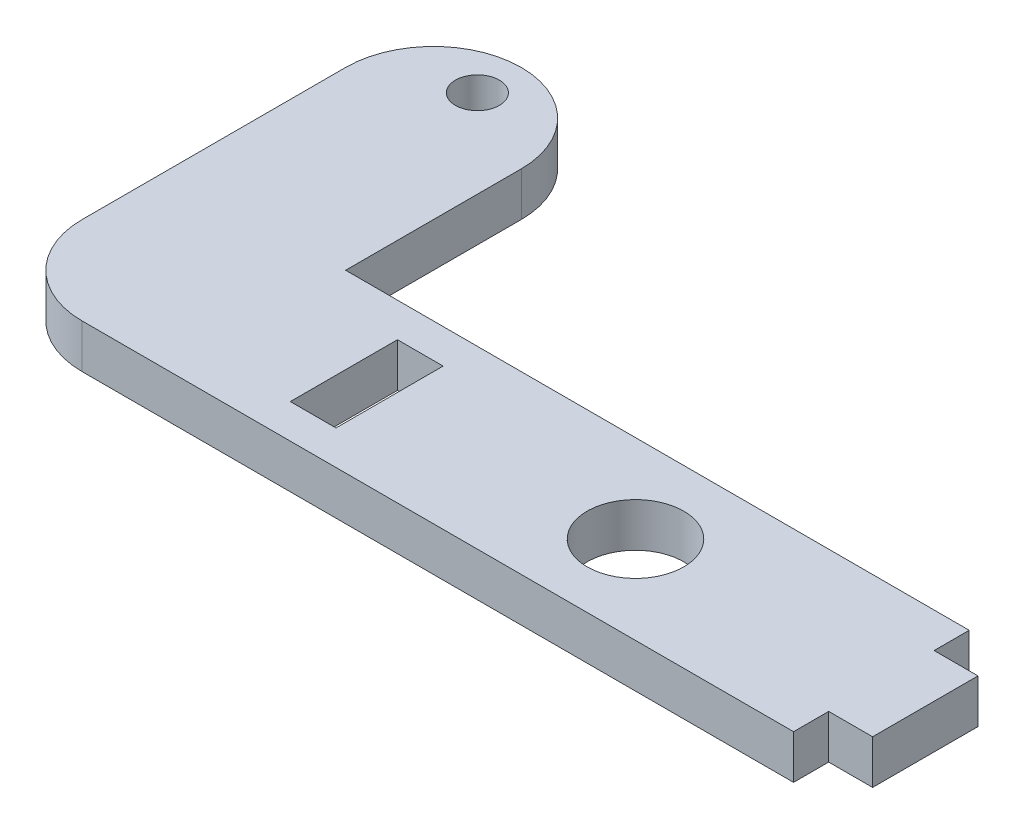
ISO-10303-21;
HEADER;
FILE_DESCRIPTION(('STEP AP214'),'2;1');
FILE_NAME('part.step','',(''),(''),'','','');
FILE_SCHEMA(('AUTOMOTIVE_DESIGN { 1 0 10303 214 1 1 1 1 }'));
ENDSEC;
DATA;
#1=APPLICATION_CONTEXT('core data for automotive mechanical design processes');
#2=APPLICATION_PROTOCOL_DEFINITION('international standard','automotive_design',2000,#1);
#3=PRODUCT_CONTEXT('',#1,'mechanical');
#4=PRODUCT('Part','Part','',(#3));
#5=PRODUCT_RELATED_PRODUCT_CATEGORY('part','',(#4));
#6=PRODUCT_DEFINITION_FORMATION('','',#4);
#7=PRODUCT_DEFINITION_CONTEXT('part definition',#1,'design');
#8=PRODUCT_DEFINITION('design','',#6,#7);
#9=PRODUCT_DEFINITION_SHAPE('','',#8);
#10=(LENGTH_UNIT() NAMED_UNIT(*) SI_UNIT(.MILLI.,.METRE.));
#11=(NAMED_UNIT(*) PLANE_ANGLE_UNIT() SI_UNIT($,.RADIAN.));
#12=(NAMED_UNIT(*) SI_UNIT($,.STERADIAN.) SOLID_ANGLE_UNIT());
#13=UNCERTAINTY_MEASURE_WITH_UNIT(LENGTH_MEASURE(1.E-05),#10,'distance_accuracy_value','');
#14=(GEOMETRIC_REPRESENTATION_CONTEXT(3) GLOBAL_UNCERTAINTY_ASSIGNED_CONTEXT((#13)) GLOBAL_UNIT_ASSIGNED_CONTEXT((#10,
#11,#12)) REPRESENTATION_CONTEXT('',''));
#15=CARTESIAN_POINT('',(0.,0.,0.));
#16=DIRECTION('',(0.,0.,1.));
#17=DIRECTION('',(1.,0.,0.));
#18=AXIS2_PLACEMENT_3D('',#15,#16,#17);
#19=CARTESIAN_POINT('',(-41.1780502588684,14.4756677402543,1.31851689110202));
#20=DIRECTION('',(0.,1.,0.));
#21=DIRECTION('',(0.,0.,1.));
#22=AXIS2_PLACEMENT_3D('',#19,#20,#21);
#23=CYLINDRICAL_SURFACE('',#22,6.35);
#24=DIRECTION('',(0.,1.,0.));
#25=VECTOR('',#24,1.);
#26=CARTESIAN_POINT('',(-47.5280502588684,14.4756677402543,1.31851689110202));
#27=LINE('',#26,#25);
#28=CARTESIAN_POINT('',(-47.5280502588684,11.3006677402543,1.31851689110202));
#29=VERTEX_POINT('',#28);
#30=CARTESIAN_POINT('',(-47.5280502588684,14.4756677402543,1.31851689110202));
#31=VERTEX_POINT('',#30);
#32=EDGE_CURVE('E276',#29,#31,#27,.T.);
#33=ORIENTED_EDGE('',*,*,#32,.F.);
#34=CARTESIAN_POINT('',(-41.1780502588684,11.3006677402543,1.31851689110202));
#35=DIRECTION('',(0.,-1.,0.));
#36=DIRECTION('',(0.,0.,-1.));
#37=AXIS2_PLACEMENT_3D('',#34,#35,#36);
#38=CIRCLE('',#37,6.35);
#39=CARTESIAN_POINT('',(-41.1780502588684,11.3006677402543,7.66851689110202));
#40=VERTEX_POINT('',#39);
#41=EDGE_CURVE('E39',#40,#29,#38,.T.);
#42=ORIENTED_EDGE('',*,*,#41,.F.);
#43=DIRECTION('',(0.,1.,0.));
#44=VECTOR('',#43,1.);
#45=CARTESIAN_POINT('',(-41.1780502588684,14.4756677402543,7.66851689110202));
#46=LINE('',#45,#44);
#47=CARTESIAN_POINT('',(-41.1780502588684,14.4756677402543,7.66851689110202));
#48=VERTEX_POINT('',#47);
#49=EDGE_CURVE('E279',#48,#40,#46,.F.);
#50=ORIENTED_EDGE('',*,*,#49,.F.);
#51=CARTESIAN_POINT('',(-41.1780502588684,14.4756677402543,1.31851689110202));
#52=DIRECTION('',(0.,-1.,0.));
#53=DIRECTION('',(0.,0.,-1.));
#54=AXIS2_PLACEMENT_3D('',#51,#52,#53);
#55=CIRCLE('',#54,6.35);
#56=EDGE_CURVE('E11',#31,#48,#55,.F.);
#57=ORIENTED_EDGE('',*,*,#56,.F.);
#58=EDGE_LOOP('',(#33,#42,#50,#57));
#59=FACE_BOUND('',#58,.T.);
#60=ADVANCED_FACE('F32',(#59),#23,.T.);
#61=CARTESIAN_POINT('',(-41.1780502588684,14.4756677402543,-17.731483108898));
#62=DIRECTION('',(0.,-1.,0.));
#63=DIRECTION('',(0.,0.,-1.));
#64=AXIS2_PLACEMENT_3D('',#61,#62,#63);
#65=CYLINDRICAL_SURFACE('',#64,6.35);
#66=DIRECTION('',(0.,1.,0.));
#67=VECTOR('',#66,1.);
#68=CARTESIAN_POINT('',(-41.1780502588684,14.4756677402543,-24.081483108898));
#69=LINE('',#68,#67);
#70=CARTESIAN_POINT('',(-41.1780502588684,11.3006677402543,-24.081483108898));
#71=VERTEX_POINT('',#70);
#72=CARTESIAN_POINT('',(-41.1780502588684,14.4756677402543,-24.081483108898));
#73=VERTEX_POINT('',#72);
#74=EDGE_CURVE('E258',#71,#73,#69,.T.);
#75=ORIENTED_EDGE('',*,*,#74,.T.);
#76=CARTESIAN_POINT('',(-41.1780502588684,14.4756677402543,-17.731483108898));
#77=DIRECTION('',(0.,-1.,0.));
#78=DIRECTION('',(0.,0.,-1.));
#79=AXIS2_PLACEMENT_3D('',#76,#77,#78);
#80=CIRCLE('',#79,6.35);
#81=CARTESIAN_POINT('',(-34.8280502588684,14.4756677402543,-17.731483108898));
#82=VERTEX_POINT('',#81);
#83=EDGE_CURVE('E272',#82,#73,#80,.F.);
#84=ORIENTED_EDGE('',*,*,#83,.F.);
#85=DIRECTION('',(0.,-1.,0.));
#86=VECTOR('',#85,1.);
#87=CARTESIAN_POINT('',(-34.8280502588684,14.4756677402543,-17.731483108898));
#88=LINE('',#87,#86);
#89=CARTESIAN_POINT('',(-34.8280502588684,11.3006677402543,-17.731483108898));
#90=VERTEX_POINT('',#89);
#91=EDGE_CURVE('E269',#90,#82,#88,.F.);
#92=ORIENTED_EDGE('',*,*,#91,.F.);
#93=CARTESIAN_POINT('',(-41.1780502588684,11.3006677402543,-17.731483108898));
#94=DIRECTION('',(0.,-1.,0.));
#95=DIRECTION('',(0.,0.,-1.));
#96=AXIS2_PLACEMENT_3D('',#93,#94,#95);
#97=CIRCLE('',#96,6.35);
#98=EDGE_CURVE('E274',#71,#90,#97,.T.);
#99=ORIENTED_EDGE('',*,*,#98,.F.);
#100=EDGE_LOOP('',(#75,#84,#92,#99));
#101=FACE_BOUND('',#100,.T.);
#102=ADVANCED_FACE('F293',(#101),#65,.T.);
#103=CARTESIAN_POINT('',(-41.1780502588684,14.4756677402543,-17.731483108898));
#104=DIRECTION('',(0.,1.,0.));
#105=DIRECTION('',(0.,0.,1.));
#106=AXIS2_PLACEMENT_3D('',#103,#104,#105);
#107=CYLINDRICAL_SURFACE('',#106,6.35);
#108=ORIENTED_EDGE('',*,*,#74,.F.);
#109=CARTESIAN_POINT('',(-41.1780502588684,11.3006677402543,-17.731483108898));
#110=DIRECTION('',(0.,-1.,0.));
#111=DIRECTION('',(0.,0.,-1.));
#112=AXIS2_PLACEMENT_3D('',#109,#110,#111);
#113=CIRCLE('',#112,6.35);
#114=CARTESIAN_POINT('',(-47.5280502588684,11.3006677402543,-17.731483108898));
#115=VERTEX_POINT('',#114);
#116=EDGE_CURVE('E264',#115,#71,#113,.T.);
#117=ORIENTED_EDGE('',*,*,#116,.F.);
#118=DIRECTION('',(0.,1.,0.));
#119=VECTOR('',#118,1.);
#120=CARTESIAN_POINT('',(-47.5280502588684,14.4756677402543,-17.731483108898));
#121=LINE('',#120,#119);
#122=CARTESIAN_POINT('',(-47.5280502588684,14.4756677402543,-17.731483108898));
#123=VERTEX_POINT('',#122);
#124=EDGE_CURVE('E261',#123,#115,#121,.F.);
#125=ORIENTED_EDGE('',*,*,#124,.F.);
#126=CARTESIAN_POINT('',(-41.1780502588684,14.4756677402543,-17.731483108898));
#127=DIRECTION('',(0.,-1.,0.));
#128=DIRECTION('',(0.,0.,-1.));
#129=AXIS2_PLACEMENT_3D('',#126,#127,#128);
#130=CIRCLE('',#129,6.35);
#131=EDGE_CURVE('E267',#73,#123,#130,.F.);
#132=ORIENTED_EDGE('',*,*,#131,.F.);
#133=EDGE_LOOP('',(#108,#117,#125,#132));
#134=FACE_BOUND('',#133,.T.);
#135=ADVANCED_FACE('F288',(#134),#107,.T.);
#136=CARTESIAN_POINT('',(-17.0480502588684,14.4756677402543,1.31851689110202));
#137=DIRECTION('',(0.,-1.,0.));
#138=DIRECTION('',(0.,0.,-1.));
#139=AXIS2_PLACEMENT_3D('',#136,#137,#138);
#140=PLANE('',#139);
#141=CARTESIAN_POINT('',(-7.52305025886841,14.4756677402543,1.31851689110202));
#142=DIRECTION('',(0.,1.,0.));
#143=DIRECTION('',(0.,0.,1.));
#144=AXIS2_PLACEMENT_3D('',#141,#142,#143);
#145=CIRCLE('',#144,3.4925);
#146=CARTESIAN_POINT('',(-7.52305025886841,14.4756677402543,4.81101689110202));
#147=VERTEX_POINT('',#146);
#148=EDGE_CURVE('E171',#147,#147,#145,.T.);
#149=ORIENTED_EDGE('',*,*,#148,.F.);
#150=EDGE_LOOP('',(#149));
#151=FACE_BOUND('',#150,.T.);
#152=CARTESIAN_POINT('',(-41.1780502588684,14.4756677402543,-20.906483108898));
#153=DIRECTION('',(0.,1.,0.));
#154=DIRECTION('',(0.,0.,1.));
#155=AXIS2_PLACEMENT_3D('',#152,#153,#154);
#156=CIRCLE('',#155,1.5875);
#157=CARTESIAN_POINT('',(-41.1780502588684,14.4756677402543,-19.318983108898));
#158=VERTEX_POINT('',#157);
#159=EDGE_CURVE('E228',#158,#158,#156,.T.);
#160=ORIENTED_EDGE('',*,*,#159,.F.);
#161=EDGE_LOOP('',(#160));
#162=FACE_BOUND('',#161,.T.);
#163=DIRECTION('',(0.,0.,1.));
#164=VECTOR('',#163,1.);
#165=CARTESIAN_POINT('',(-47.5280502588684,14.4756677402543,-5.03148310889799));
#166=LINE('',#165,#164);
#167=EDGE_CURVE('E234',#123,#31,#166,.T.);
#168=ORIENTED_EDGE('',*,*,#167,.T.);
#169=ORIENTED_EDGE('',*,*,#56,.T.);
#170=DIRECTION('',(1.,0.,0.));
#171=VECTOR('',#170,1.);
#172=CARTESIAN_POINT('',(-47.5280502588684,14.4756677402543,7.66851689110202));
#173=LINE('',#172,#171);
#174=CARTESIAN_POINT('',(10.2569497411316,14.4756677402543,7.66851689110202));
#175=VERTEX_POINT('',#174);
#176=EDGE_CURVE('E236',#48,#175,#173,.T.);
#177=ORIENTED_EDGE('',*,*,#176,.T.);
#178=DIRECTION('',(0.,0.,1.));
#179=VECTOR('',#178,1.);
#180=CARTESIAN_POINT('',(10.2569497411316,14.4756677402543,7.66851689110202));
#181=LINE('',#180,#179);
#182=CARTESIAN_POINT('',(10.2569497411316,14.4756677402543,5.12851689110202));
#183=VERTEX_POINT('',#182);
#184=EDGE_CURVE('E167',#183,#175,#181,.T.);
#185=ORIENTED_EDGE('',*,*,#184,.F.);
#186=DIRECTION('',(-1.,0.,0.));
#187=VECTOR('',#186,1.);
#188=CARTESIAN_POINT('',(13.4319497411316,14.4756677402543,5.12851689110202));
#189=LINE('',#188,#187);
#190=CARTESIAN_POINT('',(13.4319497411316,14.4756677402543,5.12851689110202));
#191=VERTEX_POINT('',#190);
#192=EDGE_CURVE('E147',#191,#183,#189,.T.);
#193=ORIENTED_EDGE('',*,*,#192,.F.);
#194=DIRECTION('',(0.,0.,-1.));
#195=VECTOR('',#194,1.);
#196=CARTESIAN_POINT('',(13.4319497411316,14.4756677402543,-5.03148310889798));
#197=LINE('',#196,#195);
#198=CARTESIAN_POINT('',(13.4319497411316,14.4756677402543,-2.49148310889798));
#199=VERTEX_POINT('',#198);
#200=EDGE_CURVE('E239',#191,#199,#197,.T.);
#201=ORIENTED_EDGE('',*,*,#200,.T.);
#202=DIRECTION('',(1.,0.,0.));
#203=VECTOR('',#202,1.);
#204=CARTESIAN_POINT('',(13.4319497411316,14.4756677402543,-2.49148310889798));
#205=LINE('',#204,#203);
#206=CARTESIAN_POINT('',(10.2569497411316,14.4756677402543,-2.49148310889798));
#207=VERTEX_POINT('',#206);
#208=EDGE_CURVE('E183',#207,#199,#205,.T.);
#209=ORIENTED_EDGE('',*,*,#208,.F.);
#210=DIRECTION('',(0.,0.,1.));
#211=VECTOR('',#210,1.);
#212=CARTESIAN_POINT('',(10.2569497411316,14.4756677402543,-5.03148310889798));
#213=LINE('',#212,#211);
#214=CARTESIAN_POINT('',(10.2569497411316,14.4756677402543,-5.03148310889798));
#215=VERTEX_POINT('',#214);
#216=EDGE_CURVE('E176',#215,#207,#213,.T.);
#217=ORIENTED_EDGE('',*,*,#216,.F.);
#218=DIRECTION('',(-1.,0.,0.));
#219=VECTOR('',#218,1.);
#220=CARTESIAN_POINT('',(13.4319497411316,14.4756677402543,-5.03148310889798));
#221=LINE('',#220,#219);
#222=CARTESIAN_POINT('',(-34.8280502588684,14.4756677402543,-5.03148310889798));
#223=VERTEX_POINT('',#222);
#224=EDGE_CURVE('E241',#215,#223,#221,.T.);
#225=ORIENTED_EDGE('',*,*,#224,.T.);
#226=DIRECTION('',(0.,0.,-1.));
#227=VECTOR('',#226,1.);
#228=CARTESIAN_POINT('',(-34.8280502588684,14.4756677402543,-5.03148310889798));
#229=LINE('',#228,#227);
#230=EDGE_CURVE('E243',#223,#82,#229,.T.);
#231=ORIENTED_EDGE('',*,*,#230,.T.);
#232=ORIENTED_EDGE('',*,*,#83,.T.);
#233=ORIENTED_EDGE('',*,*,#131,.T.);
#234=EDGE_LOOP('',(#168,#169,#177,#185,#193,#201,#209,#217,#225,#231,#232,#233));
#235=FACE_BOUND('',#234,.T.);
#236=DIRECTION('',(0.,0.,1.));
#237=VECTOR('',#236,1.);
#238=CARTESIAN_POINT('',(-28.6050502588684,14.4756677402543,-2.55498310889798));
#239=LINE('',#238,#237);
#240=CARTESIAN_POINT('',(-28.6050502588684,14.4756677402543,-2.55498310889798));
#241=VERTEX_POINT('',#240);
#242=CARTESIAN_POINT('',(-28.6050502588684,14.4756677402543,5.19201689110202));
#243=VERTEX_POINT('',#242);
#244=EDGE_CURVE('E197',#241,#243,#239,.T.);
#245=ORIENTED_EDGE('',*,*,#244,.F.);
#246=DIRECTION('',(-1.,0.,0.));
#247=VECTOR('',#246,1.);
#248=CARTESIAN_POINT('',(-28.6050502588684,14.4756677402543,-2.55498310889798));
#249=LINE('',#248,#247);
#250=CARTESIAN_POINT('',(-25.3030502588684,14.4756677402543,-2.55498310889798));
#251=VERTEX_POINT('',#250);
#252=EDGE_CURVE('E205',#251,#241,#249,.T.);
#253=ORIENTED_EDGE('',*,*,#252,.F.);
#254=DIRECTION('',(0.,0.,-1.));
#255=VECTOR('',#254,1.);
#256=CARTESIAN_POINT('',(-25.3030502588684,14.4756677402543,-2.55498310889798));
#257=LINE('',#256,#255);
#258=CARTESIAN_POINT('',(-25.3030502588684,14.4756677402543,5.19201689110202));
#259=VERTEX_POINT('',#258);
#260=EDGE_CURVE('E202',#259,#251,#257,.T.);
#261=ORIENTED_EDGE('',*,*,#260,.F.);
#262=DIRECTION('',(1.,0.,0.));
#263=VECTOR('',#262,1.);
#264=CARTESIAN_POINT('',(-28.6050502588684,14.4756677402543,5.19201689110202));
#265=LINE('',#264,#263);
#266=EDGE_CURVE('E199',#243,#259,#265,.T.);
#267=ORIENTED_EDGE('',*,*,#266,.F.);
#268=EDGE_LOOP('',(#245,#253,#261,#267));
#269=FACE_BOUND('',#268,.T.);
#270=ADVANCED_FACE('F313',(#151,#162,#235,#269),#140,.F.);
#271=CARTESIAN_POINT('',(-17.0480502588684,11.3006677402543,1.31851689110202));
#272=DIRECTION('',(0.,-1.,0.));
#273=DIRECTION('',(0.,0.,-1.));
#274=AXIS2_PLACEMENT_3D('',#271,#272,#273);
#275=PLANE('',#274);
#276=CARTESIAN_POINT('',(-7.52305025886841,11.3006677402543,1.31851689110202));
#277=DIRECTION('',(0.,1.,0.));
#278=DIRECTION('',(0.,0.,1.));
#279=AXIS2_PLACEMENT_3D('',#276,#277,#278);
#280=CIRCLE('',#279,3.4925);
#281=CARTESIAN_POINT('',(-7.52305025886841,11.3006677402543,4.81101689110202));
#282=VERTEX_POINT('',#281);
#283=EDGE_CURVE('E174',#282,#282,#280,.T.);
#284=ORIENTED_EDGE('',*,*,#283,.T.);
#285=EDGE_LOOP('',(#284));
#286=FACE_BOUND('',#285,.T.);
#287=DIRECTION('',(1.,0.,0.));
#288=VECTOR('',#287,1.);
#289=CARTESIAN_POINT('',(-47.5280502588684,11.3006677402543,7.66851689110202));
#290=LINE('',#289,#288);
#291=CARTESIAN_POINT('',(10.2569497411316,11.3006677402543,7.66851689110202));
#292=VERTEX_POINT('',#291);
#293=EDGE_CURVE('E249',#40,#292,#290,.T.);
#294=ORIENTED_EDGE('',*,*,#293,.F.);
#295=ORIENTED_EDGE('',*,*,#41,.T.);
#296=DIRECTION('',(0.,0.,1.));
#297=VECTOR('',#296,1.);
#298=CARTESIAN_POINT('',(-47.5280502588684,11.3006677402543,-5.03148310889799));
#299=LINE('',#298,#297);
#300=EDGE_CURVE('E231',#115,#29,#299,.T.);
#301=ORIENTED_EDGE('',*,*,#300,.F.);
#302=ORIENTED_EDGE('',*,*,#116,.T.);
#303=ORIENTED_EDGE('',*,*,#98,.T.);
#304=DIRECTION('',(0.,0.,-1.));
#305=VECTOR('',#304,1.);
#306=CARTESIAN_POINT('',(-34.8280502588684,11.3006677402543,-5.03148310889798));
#307=LINE('',#306,#305);
#308=CARTESIAN_POINT('',(-34.8280502588684,11.3006677402543,-5.03148310889798));
#309=VERTEX_POINT('',#308);
#310=EDGE_CURVE('E237',#309,#90,#307,.T.);
#311=ORIENTED_EDGE('',*,*,#310,.F.);
#312=DIRECTION('',(-1.,0.,0.));
#313=VECTOR('',#312,1.);
#314=CARTESIAN_POINT('',(13.4319497411316,11.3006677402543,-5.03148310889798));
#315=LINE('',#314,#313);
#316=CARTESIAN_POINT('',(10.2569497411316,11.3006677402543,-5.03148310889798));
#317=VERTEX_POINT('',#316);
#318=EDGE_CURVE('E252',#317,#309,#315,.T.);
#319=ORIENTED_EDGE('',*,*,#318,.F.);
#320=DIRECTION('',(0.,0.,1.));
#321=VECTOR('',#320,1.);
#322=CARTESIAN_POINT('',(10.2569497411316,11.3006677402543,-5.03148310889798));
#323=LINE('',#322,#321);
#324=CARTESIAN_POINT('',(10.2569497411316,11.3006677402543,-2.49148310889798));
#325=VERTEX_POINT('',#324);
#326=EDGE_CURVE('E179',#317,#325,#323,.T.);
#327=ORIENTED_EDGE('',*,*,#326,.T.);
#328=DIRECTION('',(1.,0.,0.));
#329=VECTOR('',#328,1.);
#330=CARTESIAN_POINT('',(13.4319497411316,11.3006677402543,-2.49148310889798));
#331=LINE('',#330,#329);
#332=CARTESIAN_POINT('',(13.4319497411316,11.3006677402543,-2.49148310889798));
#333=VERTEX_POINT('',#332);
#334=EDGE_CURVE('E182',#325,#333,#331,.T.);
#335=ORIENTED_EDGE('',*,*,#334,.T.);
#336=DIRECTION('',(0.,0.,-1.));
#337=VECTOR('',#336,1.);
#338=CARTESIAN_POINT('',(13.4319497411316,11.3006677402543,-5.03148310889798));
#339=LINE('',#338,#337);
#340=CARTESIAN_POINT('',(13.4319497411316,11.3006677402543,5.12851689110202));
#341=VERTEX_POINT('',#340);
#342=EDGE_CURVE('E166',#341,#333,#339,.T.);
#343=ORIENTED_EDGE('',*,*,#342,.F.);
#344=DIRECTION('',(-1.,0.,0.));
#345=VECTOR('',#344,1.);
#346=CARTESIAN_POINT('',(13.4319497411316,11.3006677402543,5.12851689110202));
#347=LINE('',#346,#345);
#348=CARTESIAN_POINT('',(10.2569497411316,11.3006677402543,5.12851689110202));
#349=VERTEX_POINT('',#348);
#350=EDGE_CURVE('E144',#341,#349,#347,.T.);
#351=ORIENTED_EDGE('',*,*,#350,.T.);
#352=DIRECTION('',(0.,0.,1.));
#353=VECTOR('',#352,1.);
#354=CARTESIAN_POINT('',(10.2569497411316,11.3006677402543,7.66851689110202));
#355=LINE('',#354,#353);
#356=EDGE_CURVE('E156',#349,#292,#355,.T.);
#357=ORIENTED_EDGE('',*,*,#356,.T.);
#358=EDGE_LOOP('',(#294,#295,#301,#302,#303,#311,#319,#327,#335,#343,#351,#357));
#359=FACE_BOUND('',#358,.T.);
#360=CARTESIAN_POINT('',(-41.1780502588684,11.3006677402543,-20.906483108898));
#361=DIRECTION('',(0.,1.,0.));
#362=DIRECTION('',(0.,0.,1.));
#363=AXIS2_PLACEMENT_3D('',#360,#361,#362);
#364=CIRCLE('',#363,1.5875);
#365=CARTESIAN_POINT('',(-41.1780502588684,11.3006677402543,-19.318983108898));
#366=VERTEX_POINT('',#365);
#367=EDGE_CURVE('E227',#366,#366,#364,.T.);
#368=ORIENTED_EDGE('',*,*,#367,.T.);
#369=EDGE_LOOP('',(#368));
#370=FACE_BOUND('',#369,.T.);
#371=DIRECTION('',(-1.,0.,0.));
#372=VECTOR('',#371,1.);
#373=CARTESIAN_POINT('',(-28.6050502588684,11.3006677402543,-2.55498310889798));
#374=LINE('',#373,#372);
#375=CARTESIAN_POINT('',(-25.3030502588684,11.3006677402543,-2.55498310889798));
#376=VERTEX_POINT('',#375);
#377=CARTESIAN_POINT('',(-28.6050502588684,11.3006677402543,-2.55498310889798));
#378=VERTEX_POINT('',#377);
#379=EDGE_CURVE('E200',#376,#378,#374,.T.);
#380=ORIENTED_EDGE('',*,*,#379,.T.);
#381=DIRECTION('',(0.,0.,1.));
#382=VECTOR('',#381,1.);
#383=CARTESIAN_POINT('',(-28.6050502588684,11.3006677402543,-2.55498310889798));
#384=LINE('',#383,#382);
#385=CARTESIAN_POINT('',(-28.6050502588684,11.3006677402543,5.19201689110202));
#386=VERTEX_POINT('',#385);
#387=EDGE_CURVE('E193',#378,#386,#384,.T.);
#388=ORIENTED_EDGE('',*,*,#387,.T.);
#389=DIRECTION('',(1.,0.,0.));
#390=VECTOR('',#389,1.);
#391=CARTESIAN_POINT('',(-28.6050502588684,11.3006677402543,5.19201689110202));
#392=LINE('',#391,#390);
#393=CARTESIAN_POINT('',(-25.3030502588684,11.3006677402543,5.19201689110202));
#394=VERTEX_POINT('',#393);
#395=EDGE_CURVE('E210',#386,#394,#392,.T.);
#396=ORIENTED_EDGE('',*,*,#395,.T.);
#397=DIRECTION('',(0.,0.,-1.));
#398=VECTOR('',#397,1.);
#399=CARTESIAN_POINT('',(-25.3030502588684,11.3006677402543,-2.55498310889798));
#400=LINE('',#399,#398);
#401=EDGE_CURVE('E213',#394,#376,#400,.T.);
#402=ORIENTED_EDGE('',*,*,#401,.T.);
#403=EDGE_LOOP('',(#380,#388,#396,#402));
#404=FACE_BOUND('',#403,.T.);
#405=ADVANCED_FACE('F163',(#286,#359,#370,#404),#275,.T.);
#406=CARTESIAN_POINT('',(-47.5280502588684,14.4756677402543,-5.03148310889799));
#407=DIRECTION('',(1.,0.,0.));
#408=DIRECTION('',(0.,0.,-1.));
#409=AXIS2_PLACEMENT_3D('',#406,#407,#408);
#410=PLANE('',#409);
#411=ORIENTED_EDGE('',*,*,#300,.T.);
#412=ORIENTED_EDGE('',*,*,#32,.T.);
#413=ORIENTED_EDGE('',*,*,#167,.F.);
#414=ORIENTED_EDGE('',*,*,#124,.T.);
#415=EDGE_LOOP('',(#411,#412,#413,#414));
#416=FACE_BOUND('',#415,.T.);
#417=ADVANCED_FACE('F283',(#416),#410,.F.);
#418=CARTESIAN_POINT('',(-47.5280502588684,14.4756677402543,7.66851689110202));
#419=DIRECTION('',(0.,0.,-1.));
#420=DIRECTION('',(-1.,0.,0.));
#421=AXIS2_PLACEMENT_3D('',#418,#419,#420);
#422=PLANE('',#421);
#423=ORIENTED_EDGE('',*,*,#176,.F.);
#424=ORIENTED_EDGE('',*,*,#49,.T.);
#425=ORIENTED_EDGE('',*,*,#293,.T.);
#426=DIRECTION('',(0.,1.,0.));
#427=VECTOR('',#426,1.);
#428=CARTESIAN_POINT('',(10.2569497411316,11.3006677402543,7.66851689110202));
#429=LINE('',#428,#427);
#430=EDGE_CURVE('E151',#292,#175,#429,.T.);
#431=ORIENTED_EDGE('',*,*,#430,.T.);
#432=EDGE_LOOP('',(#423,#424,#425,#431));
#433=FACE_BOUND('',#432,.T.);
#434=ADVANCED_FACE('F317',(#433),#422,.F.);
#435=CARTESIAN_POINT('',(13.4319497411316,14.4756677402543,-5.03148310889798));
#436=DIRECTION('',(-1.,0.,0.));
#437=DIRECTION('',(0.,0.,1.));
#438=AXIS2_PLACEMENT_3D('',#435,#436,#437);
#439=PLANE('',#438);
#440=ORIENTED_EDGE('',*,*,#200,.F.);
#441=DIRECTION('',(0.,1.,0.));
#442=VECTOR('',#441,1.);
#443=CARTESIAN_POINT('',(13.4319497411316,11.3006677402543,5.12851689110202));
#444=LINE('',#443,#442);
#445=EDGE_CURVE('E152',#341,#191,#444,.T.);
#446=ORIENTED_EDGE('',*,*,#445,.F.);
#447=ORIENTED_EDGE('',*,*,#342,.T.);
#448=DIRECTION('',(0.,1.,0.));
#449=VECTOR('',#448,1.);
#450=CARTESIAN_POINT('',(13.4319497411316,11.3006677402543,-2.49148310889798));
#451=LINE('',#450,#449);
#452=EDGE_CURVE('E190',#333,#199,#451,.T.);
#453=ORIENTED_EDGE('',*,*,#452,.T.);
#454=EDGE_LOOP('',(#440,#446,#447,#453));
#455=FACE_BOUND('',#454,.T.);
#456=ADVANCED_FACE('F312',(#455),#439,.F.);
#457=CARTESIAN_POINT('',(13.4319497411316,14.4756677402543,-5.03148310889798));
#458=DIRECTION('',(0.,0.,1.));
#459=DIRECTION('',(1.,0.,0.));
#460=AXIS2_PLACEMENT_3D('',#457,#458,#459);
#461=PLANE('',#460);
#462=ORIENTED_EDGE('',*,*,#224,.F.);
#463=DIRECTION('',(0.,1.,0.));
#464=VECTOR('',#463,1.);
#465=CARTESIAN_POINT('',(10.2569497411316,11.3006677402543,-5.03148310889798));
#466=LINE('',#465,#464);
#467=EDGE_CURVE('E185',#317,#215,#466,.T.);
#468=ORIENTED_EDGE('',*,*,#467,.F.);
#469=ORIENTED_EDGE('',*,*,#318,.T.);
#470=DIRECTION('',(0.,-1.,0.));
#471=VECTOR('',#470,1.);
#472=CARTESIAN_POINT('',(-34.8280502588684,14.4756677402543,-5.03148310889798));
#473=LINE('',#472,#471);
#474=EDGE_CURVE('E246',#223,#309,#473,.T.);
#475=ORIENTED_EDGE('',*,*,#474,.F.);
#476=EDGE_LOOP('',(#462,#468,#469,#475));
#477=FACE_BOUND('',#476,.T.);
#478=ADVANCED_FACE('F300',(#477),#461,.F.);
#479=CARTESIAN_POINT('',(-34.8280502588684,14.4756677402543,-5.03148310889798));
#480=DIRECTION('',(-1.,0.,0.));
#481=DIRECTION('',(0.,0.,1.));
#482=AXIS2_PLACEMENT_3D('',#479,#480,#481);
#483=PLANE('',#482);
#484=ORIENTED_EDGE('',*,*,#310,.T.);
#485=ORIENTED_EDGE('',*,*,#91,.T.);
#486=ORIENTED_EDGE('',*,*,#230,.F.);
#487=ORIENTED_EDGE('',*,*,#474,.T.);
#488=EDGE_LOOP('',(#484,#485,#486,#487));
#489=FACE_BOUND('',#488,.T.);
#490=ADVANCED_FACE('F296',(#489),#483,.F.);
#491=CARTESIAN_POINT('',(-41.1780502588684,14.4756677402543,-20.906483108898));
#492=DIRECTION('',(0.,-1.,0.));
#493=DIRECTION('',(0.,0.,-1.));
#494=AXIS2_PLACEMENT_3D('',#491,#492,#493);
#495=CYLINDRICAL_SURFACE('',#494,1.5875);
#496=ORIENTED_EDGE('',*,*,#159,.T.);
#497=EDGE_LOOP('',(#496));
#498=FACE_BOUND('',#497,.T.);
#499=ORIENTED_EDGE('',*,*,#367,.F.);
#500=EDGE_LOOP('',(#499));
#501=FACE_BOUND('',#500,.T.);
#502=ADVANCED_FACE('F347',(#498,#501),#495,.F.);
#503=CARTESIAN_POINT('',(-28.6050502588684,14.4756677402543,-2.55498310889798));
#504=DIRECTION('',(1.,0.,0.));
#505=DIRECTION('',(0.,0.,-1.));
#506=AXIS2_PLACEMENT_3D('',#503,#504,#505);
#507=PLANE('',#506);
#508=ORIENTED_EDGE('',*,*,#387,.F.);
#509=DIRECTION('',(0.,-1.,0.));
#510=VECTOR('',#509,1.);
#511=CARTESIAN_POINT('',(-28.6050502588684,14.4756677402543,-2.55498310889798));
#512=LINE('',#511,#510);
#513=EDGE_CURVE('E207',#241,#378,#512,.T.);
#514=ORIENTED_EDGE('',*,*,#513,.F.);
#515=ORIENTED_EDGE('',*,*,#244,.T.);
#516=DIRECTION('',(0.,-1.,0.));
#517=VECTOR('',#516,1.);
#518=CARTESIAN_POINT('',(-28.6050502588684,14.4756677402543,5.19201689110202));
#519=LINE('',#518,#517);
#520=EDGE_CURVE('E224',#243,#386,#519,.T.);
#521=ORIENTED_EDGE('',*,*,#520,.T.);
#522=EDGE_LOOP('',(#508,#514,#515,#521));
#523=FACE_BOUND('',#522,.T.);
#524=ADVANCED_FACE('F367',(#523),#507,.T.);
#525=CARTESIAN_POINT('',(-28.6050502588684,14.4756677402543,5.19201689110202));
#526=DIRECTION('',(0.,0.,-1.));
#527=DIRECTION('',(-1.,0.,0.));
#528=AXIS2_PLACEMENT_3D('',#525,#526,#527);
#529=PLANE('',#528);
#530=ORIENTED_EDGE('',*,*,#395,.F.);
#531=ORIENTED_EDGE('',*,*,#520,.F.);
#532=ORIENTED_EDGE('',*,*,#266,.T.);
#533=DIRECTION('',(0.,-1.,0.));
#534=VECTOR('',#533,1.);
#535=CARTESIAN_POINT('',(-25.3030502588684,14.4756677402543,5.19201689110202));
#536=LINE('',#535,#534);
#537=EDGE_CURVE('E222',#259,#394,#536,.T.);
#538=ORIENTED_EDGE('',*,*,#537,.T.);
#539=EDGE_LOOP('',(#530,#531,#532,#538));
#540=FACE_BOUND('',#539,.T.);
#541=ADVANCED_FACE('F374',(#540),#529,.T.);
#542=CARTESIAN_POINT('',(-25.3030502588684,14.4756677402543,-2.55498310889798));
#543=DIRECTION('',(-1.,0.,0.));
#544=DIRECTION('',(0.,0.,1.));
#545=AXIS2_PLACEMENT_3D('',#542,#543,#544);
#546=PLANE('',#545);
#547=ORIENTED_EDGE('',*,*,#401,.F.);
#548=ORIENTED_EDGE('',*,*,#537,.F.);
#549=ORIENTED_EDGE('',*,*,#260,.T.);
#550=DIRECTION('',(0.,-1.,0.));
#551=VECTOR('',#550,1.);
#552=CARTESIAN_POINT('',(-25.3030502588684,14.4756677402543,-2.55498310889798));
#553=LINE('',#552,#551);
#554=EDGE_CURVE('E220',#251,#376,#553,.T.);
#555=ORIENTED_EDGE('',*,*,#554,.T.);
#556=EDGE_LOOP('',(#547,#548,#549,#555));
#557=FACE_BOUND('',#556,.T.);
#558=ADVANCED_FACE('F381',(#557),#546,.T.);
#559=CARTESIAN_POINT('',(-28.6050502588684,14.4756677402543,-2.55498310889798));
#560=DIRECTION('',(0.,0.,1.));
#561=DIRECTION('',(1.,0.,0.));
#562=AXIS2_PLACEMENT_3D('',#559,#560,#561);
#563=PLANE('',#562);
#564=ORIENTED_EDGE('',*,*,#379,.F.);
#565=ORIENTED_EDGE('',*,*,#554,.F.);
#566=ORIENTED_EDGE('',*,*,#252,.T.);
#567=ORIENTED_EDGE('',*,*,#513,.T.);
#568=EDGE_LOOP('',(#564,#565,#566,#567));
#569=FACE_BOUND('',#568,.T.);
#570=ADVANCED_FACE('F389',(#569),#563,.T.);
#571=CARTESIAN_POINT('',(13.4319497411316,11.3006677402543,-2.49148310889798));
#572=DIRECTION('',(0.,0.,1.));
#573=DIRECTION('',(1.,0.,0.));
#574=AXIS2_PLACEMENT_3D('',#571,#572,#573);
#575=PLANE('',#574);
#576=ORIENTED_EDGE('',*,*,#208,.T.);
#577=ORIENTED_EDGE('',*,*,#452,.F.);
#578=ORIENTED_EDGE('',*,*,#334,.F.);
#579=DIRECTION('',(0.,1.,0.));
#580=VECTOR('',#579,1.);
#581=CARTESIAN_POINT('',(10.2569497411316,11.3006677402543,-2.49148310889798));
#582=LINE('',#581,#580);
#583=EDGE_CURVE('E194',#325,#207,#582,.T.);
#584=ORIENTED_EDGE('',*,*,#583,.T.);
#585=EDGE_LOOP('',(#576,#577,#578,#584));
#586=FACE_BOUND('',#585,.T.);
#587=ADVANCED_FACE('F309',(#586),#575,.F.);
#588=CARTESIAN_POINT('',(10.2569497411316,11.3006677402543,-5.03148310889798));
#589=DIRECTION('',(-1.,0.,0.));
#590=DIRECTION('',(0.,0.,1.));
#591=AXIS2_PLACEMENT_3D('',#588,#589,#590);
#592=PLANE('',#591);
#593=ORIENTED_EDGE('',*,*,#216,.T.);
#594=ORIENTED_EDGE('',*,*,#583,.F.);
#595=ORIENTED_EDGE('',*,*,#326,.F.);
#596=ORIENTED_EDGE('',*,*,#467,.T.);
#597=EDGE_LOOP('',(#593,#594,#595,#596));
#598=FACE_BOUND('',#597,.T.);
#599=ADVANCED_FACE('F304',(#598),#592,.F.);
#600=CARTESIAN_POINT('',(10.2569497411316,11.3006677402543,7.66851689110202));
#601=DIRECTION('',(-1.,0.,0.));
#602=DIRECTION('',(0.,0.,1.));
#603=AXIS2_PLACEMENT_3D('',#600,#601,#602);
#604=PLANE('',#603);
#605=ORIENTED_EDGE('',*,*,#184,.T.);
#606=ORIENTED_EDGE('',*,*,#430,.F.);
#607=ORIENTED_EDGE('',*,*,#356,.F.);
#608=DIRECTION('',(0.,1.,0.));
#609=VECTOR('',#608,1.);
#610=CARTESIAN_POINT('',(10.2569497411316,11.3006677402543,5.12851689110202));
#611=LINE('',#610,#609);
#612=EDGE_CURVE('E140',#349,#183,#611,.T.);
#613=ORIENTED_EDGE('',*,*,#612,.T.);
#614=EDGE_LOOP('',(#605,#606,#607,#613));
#615=FACE_BOUND('',#614,.T.);
#616=ADVANCED_FACE('F157',(#615),#604,.F.);
#617=CARTESIAN_POINT('',(13.4319497411316,11.3006677402543,5.12851689110202));
#618=DIRECTION('',(0.,0.,-1.));
#619=DIRECTION('',(-1.,0.,0.));
#620=AXIS2_PLACEMENT_3D('',#617,#618,#619);
#621=PLANE('',#620);
#622=ORIENTED_EDGE('',*,*,#192,.T.);
#623=ORIENTED_EDGE('',*,*,#612,.F.);
#624=ORIENTED_EDGE('',*,*,#350,.F.);
#625=ORIENTED_EDGE('',*,*,#445,.T.);
#626=EDGE_LOOP('',(#622,#623,#624,#625));
#627=FACE_BOUND('',#626,.T.);
#628=ADVANCED_FACE('F142',(#627),#621,.F.);
#629=CARTESIAN_POINT('',(-7.52305025886841,11.3006677402543,1.31851689110202));
#630=DIRECTION('',(0.,1.,0.));
#631=DIRECTION('',(0.,0.,1.));
#632=AXIS2_PLACEMENT_3D('',#629,#630,#631);
#633=CYLINDRICAL_SURFACE('',#632,3.4925);
#634=ORIENTED_EDGE('',*,*,#283,.F.);
#635=EDGE_LOOP('',(#634));
#636=FACE_BOUND('',#635,.T.);
#637=ORIENTED_EDGE('',*,*,#148,.T.);
#638=EDGE_LOOP('',(#637));
#639=FACE_BOUND('',#638,.T.);
#640=ADVANCED_FACE('F422',(#636,#639),#633,.F.);
#641=CLOSED_SHELL('',(#60,#102,#135,#270,#405,#417,#434,#456,#478,#490,#502,#524,#541,#558,#570,
#587,#599,#616,#628,#640));
#642=MANIFOLD_SOLID_BREP('B2',#641);
#643=ADVANCED_BREP_SHAPE_REPRESENTATION('',(#18,#642),#14);
#644=SHAPE_DEFINITION_REPRESENTATION(#9,#643);
ENDSEC;
END-ISO-10303-21;
